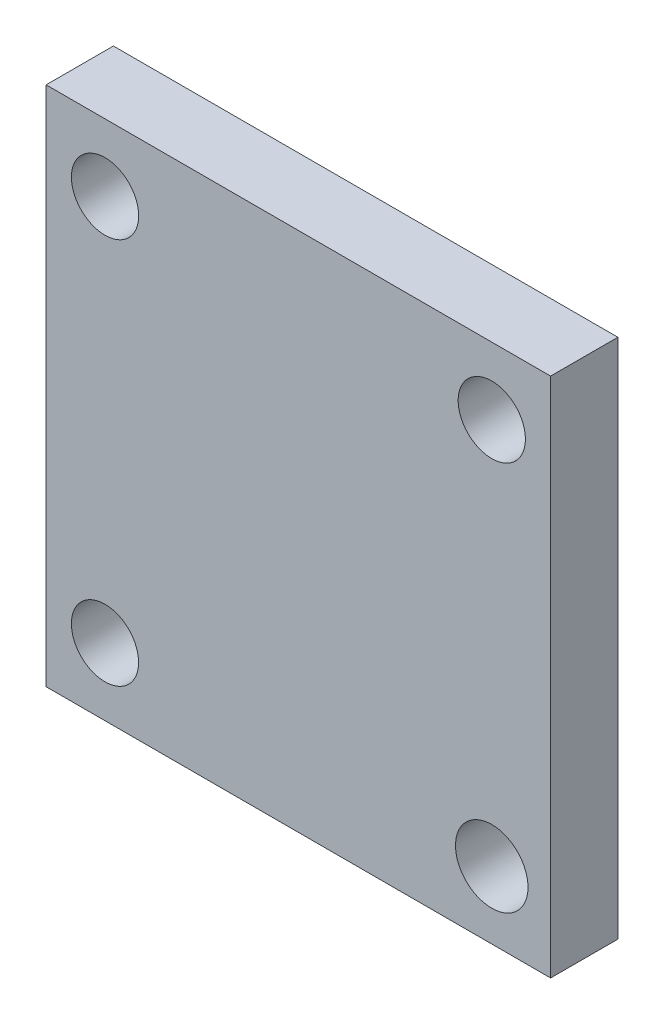
ISO-10303-21;
HEADER;
FILE_DESCRIPTION(('STEP AP214'),'2;1');
FILE_NAME('part.step','',(''),(''),'','','');
FILE_SCHEMA(('AUTOMOTIVE_DESIGN { 1 0 10303 214 1 1 1 1 }'));
ENDSEC;
DATA;
#1=APPLICATION_CONTEXT('core data for automotive mechanical design processes');
#2=APPLICATION_PROTOCOL_DEFINITION('international standard','automotive_design',2000,#1);
#3=PRODUCT_CONTEXT('',#1,'mechanical');
#4=PRODUCT('Part','Part','',(#3));
#5=PRODUCT_RELATED_PRODUCT_CATEGORY('part','',(#4));
#6=PRODUCT_DEFINITION_FORMATION('','',#4);
#7=PRODUCT_DEFINITION_CONTEXT('part definition',#1,'design');
#8=PRODUCT_DEFINITION('design','',#6,#7);
#9=PRODUCT_DEFINITION_SHAPE('','',#8);
#10=(LENGTH_UNIT() NAMED_UNIT(*) SI_UNIT(.MILLI.,.METRE.));
#11=(NAMED_UNIT(*) PLANE_ANGLE_UNIT() SI_UNIT($,.RADIAN.));
#12=(NAMED_UNIT(*) SI_UNIT($,.STERADIAN.) SOLID_ANGLE_UNIT());
#13=UNCERTAINTY_MEASURE_WITH_UNIT(LENGTH_MEASURE(1.E-05),#10,'distance_accuracy_value','');
#14=(GEOMETRIC_REPRESENTATION_CONTEXT(3) GLOBAL_UNCERTAINTY_ASSIGNED_CONTEXT((#13)) GLOBAL_UNIT_ASSIGNED_CONTEXT((#10,
#11,#12)) REPRESENTATION_CONTEXT('',''));
#15=CARTESIAN_POINT('',(0.,0.,0.));
#16=DIRECTION('',(0.,0.,1.));
#17=DIRECTION('',(1.,0.,0.));
#18=AXIS2_PLACEMENT_3D('',#15,#16,#17);
#19=CARTESIAN_POINT('',(0.,0.,4.));
#20=DIRECTION('',(0.,0.,1.));
#21=DIRECTION('',(1.,0.,0.));
#22=AXIS2_PLACEMENT_3D('',#19,#20,#21);
#23=PLANE('',#22);
#24=CARTESIAN_POINT('',(-11.501091744182,-11.4989082558181,4.));
#25=DIRECTION('',(0.,0.,1.));
#26=DIRECTION('',(1.,0.,0.));
#27=AXIS2_PLACEMENT_3D('',#24,#25,#26);
#28=CIRCLE('',#27,2.);
#29=CARTESIAN_POINT('',(-9.50109174418201,-11.4989082558181,4.));
#30=VERTEX_POINT('',#29);
#31=EDGE_CURVE('E122',#30,#30,#28,.T.);
#32=ORIENTED_EDGE('',*,*,#31,.F.);
#33=EDGE_LOOP('',(#32));
#34=FACE_BOUND('',#33,.T.);
#35=CARTESIAN_POINT('',(-11.4989082558179,11.5032752325463,4.));
#36=DIRECTION('',(0.,0.,1.));
#37=DIRECTION('',(1.,0.,0.));
#38=AXIS2_PLACEMENT_3D('',#35,#36,#37);
#39=CIRCLE('',#38,2.);
#40=CARTESIAN_POINT('',(-9.49890825581793,11.5032752325463,4.));
#41=VERTEX_POINT('',#40);
#42=EDGE_CURVE('E101',#41,#41,#39,.T.);
#43=ORIENTED_EDGE('',*,*,#42,.F.);
#44=EDGE_LOOP('',(#43));
#45=FACE_BOUND('',#44,.T.);
#46=DIRECTION('',(0.,1.,0.));
#47=VECTOR('',#46,1.);
#48=CARTESIAN_POINT('',(15.001091744182,-15.5010917441821,4.));
#49=LINE('',#48,#47);
#50=CARTESIAN_POINT('',(15.001091744182,-15.5010917441821,4.));
#51=VERTEX_POINT('',#50);
#52=CARTESIAN_POINT('',(15.001091744182,15.5010917441821,4.));
#53=VERTEX_POINT('',#52);
#54=EDGE_CURVE('E86',#51,#53,#49,.T.);
#55=ORIENTED_EDGE('',*,*,#54,.T.);
#56=DIRECTION('',(-1.,0.,0.));
#57=VECTOR('',#56,1.);
#58=CARTESIAN_POINT('',(15.001091744182,15.5010917441821,4.));
#59=LINE('',#58,#57);
#60=CARTESIAN_POINT('',(-15.001091744182,15.5010917441821,4.));
#61=VERTEX_POINT('',#60);
#62=EDGE_CURVE('E81',#53,#61,#59,.T.);
#63=ORIENTED_EDGE('',*,*,#62,.T.);
#64=DIRECTION('',(0.,-1.,0.));
#65=VECTOR('',#64,1.);
#66=CARTESIAN_POINT('',(-15.001091744182,-15.5010917441821,4.));
#67=LINE('',#66,#65);
#68=CARTESIAN_POINT('',(-15.001091744182,-15.5010917441821,4.));
#69=VERTEX_POINT('',#68);
#70=EDGE_CURVE('E84',#61,#69,#67,.T.);
#71=ORIENTED_EDGE('',*,*,#70,.T.);
#72=DIRECTION('',(1.,0.,0.));
#73=VECTOR('',#72,1.);
#74=CARTESIAN_POINT('',(15.001091744182,-15.5010917441821,4.));
#75=LINE('',#74,#73);
#76=EDGE_CURVE('E51',#69,#51,#75,.T.);
#77=ORIENTED_EDGE('',*,*,#76,.T.);
#78=EDGE_LOOP('',(#55,#63,#71,#77));
#79=FACE_BOUND('',#78,.T.);
#80=CARTESIAN_POINT('',(11.5032752325464,11.5010917441821,4.));
#81=DIRECTION('',(0.,0.,1.));
#82=DIRECTION('',(1.,0.,0.));
#83=AXIS2_PLACEMENT_3D('',#80,#81,#82);
#84=CIRCLE('',#83,2.);
#85=CARTESIAN_POINT('',(13.5032752325464,11.5010917441821,4.));
#86=VERTEX_POINT('',#85);
#87=EDGE_CURVE('E116',#86,#86,#84,.T.);
#88=ORIENTED_EDGE('',*,*,#87,.F.);
#89=EDGE_LOOP('',(#88));
#90=FACE_BOUND('',#89,.T.);
#91=CARTESIAN_POINT('',(11.5010917441823,-11.5010917441821,4.));
#92=DIRECTION('',(0.,0.,1.));
#93=DIRECTION('',(1.,0.,0.));
#94=AXIS2_PLACEMENT_3D('',#91,#92,#93);
#95=CIRCLE('',#94,2.15626689761665);
#96=CARTESIAN_POINT('',(13.657358641799,-11.5010917441821,4.));
#97=VERTEX_POINT('',#96);
#98=EDGE_CURVE('E128',#97,#97,#95,.T.);
#99=ORIENTED_EDGE('',*,*,#98,.F.);
#100=EDGE_LOOP('',(#99));
#101=FACE_BOUND('',#100,.T.);
#102=ADVANCED_FACE('F34',(#34,#45,#79,#90,#101),#23,.T.);
#103=CARTESIAN_POINT('',(0.,0.,0.));
#104=DIRECTION('',(0.,0.,1.));
#105=DIRECTION('',(1.,0.,0.));
#106=AXIS2_PLACEMENT_3D('',#103,#104,#105);
#107=PLANE('',#106);
#108=DIRECTION('',(0.,1.,0.));
#109=VECTOR('',#108,1.);
#110=CARTESIAN_POINT('',(15.001091744182,-15.5010917441821,0.));
#111=LINE('',#110,#109);
#112=CARTESIAN_POINT('',(15.001091744182,-15.5010917441821,0.));
#113=VERTEX_POINT('',#112);
#114=CARTESIAN_POINT('',(15.001091744182,15.5010917441821,0.));
#115=VERTEX_POINT('',#114);
#116=EDGE_CURVE('E98',#113,#115,#111,.T.);
#117=ORIENTED_EDGE('',*,*,#116,.F.);
#118=DIRECTION('',(1.,0.,0.));
#119=VECTOR('',#118,1.);
#120=CARTESIAN_POINT('',(15.001091744182,-15.5010917441821,0.));
#121=LINE('',#120,#119);
#122=CARTESIAN_POINT('',(-15.001091744182,-15.5010917441821,0.));
#123=VERTEX_POINT('',#122);
#124=EDGE_CURVE('E74',#123,#113,#121,.T.);
#125=ORIENTED_EDGE('',*,*,#124,.F.);
#126=DIRECTION('',(0.,-1.,0.));
#127=VECTOR('',#126,1.);
#128=CARTESIAN_POINT('',(-15.001091744182,-15.5010917441821,0.));
#129=LINE('',#128,#127);
#130=CARTESIAN_POINT('',(-15.001091744182,15.5010917441821,0.));
#131=VERTEX_POINT('',#130);
#132=EDGE_CURVE('E68',#131,#123,#129,.T.);
#133=ORIENTED_EDGE('',*,*,#132,.F.);
#134=DIRECTION('',(-1.,0.,0.));
#135=VECTOR('',#134,1.);
#136=CARTESIAN_POINT('',(15.001091744182,15.5010917441821,0.));
#137=LINE('',#136,#135);
#138=EDGE_CURVE('E90',#115,#131,#137,.T.);
#139=ORIENTED_EDGE('',*,*,#138,.F.);
#140=EDGE_LOOP('',(#117,#125,#133,#139));
#141=FACE_BOUND('',#140,.T.);
#142=CARTESIAN_POINT('',(-11.4989082558179,11.5032752325463,0.));
#143=DIRECTION('',(0.,0.,1.));
#144=DIRECTION('',(1.,0.,0.));
#145=AXIS2_PLACEMENT_3D('',#142,#143,#144);
#146=CIRCLE('',#145,2.);
#147=CARTESIAN_POINT('',(-9.49890825581793,11.5032752325463,0.));
#148=VERTEX_POINT('',#147);
#149=EDGE_CURVE('E113',#148,#148,#146,.T.);
#150=ORIENTED_EDGE('',*,*,#149,.T.);
#151=EDGE_LOOP('',(#150));
#152=FACE_BOUND('',#151,.T.);
#153=CARTESIAN_POINT('',(11.5032752325464,11.5010917441821,0.));
#154=DIRECTION('',(0.,0.,1.));
#155=DIRECTION('',(1.,0.,0.));
#156=AXIS2_PLACEMENT_3D('',#153,#154,#155);
#157=CIRCLE('',#156,2.);
#158=CARTESIAN_POINT('',(13.5032752325464,11.5010917441821,0.));
#159=VERTEX_POINT('',#158);
#160=EDGE_CURVE('E119',#159,#159,#157,.T.);
#161=ORIENTED_EDGE('',*,*,#160,.T.);
#162=EDGE_LOOP('',(#161));
#163=FACE_BOUND('',#162,.T.);
#164=CARTESIAN_POINT('',(-11.501091744182,-11.4989082558181,0.));
#165=DIRECTION('',(0.,0.,1.));
#166=DIRECTION('',(1.,0.,0.));
#167=AXIS2_PLACEMENT_3D('',#164,#165,#166);
#168=CIRCLE('',#167,2.);
#169=CARTESIAN_POINT('',(-9.50109174418201,-11.4989082558181,0.));
#170=VERTEX_POINT('',#169);
#171=EDGE_CURVE('E125',#170,#170,#168,.T.);
#172=ORIENTED_EDGE('',*,*,#171,.T.);
#173=EDGE_LOOP('',(#172));
#174=FACE_BOUND('',#173,.T.);
#175=CARTESIAN_POINT('',(11.5010917441823,-11.5010917441821,0.));
#176=DIRECTION('',(0.,0.,1.));
#177=DIRECTION('',(1.,0.,0.));
#178=AXIS2_PLACEMENT_3D('',#175,#176,#177);
#179=CIRCLE('',#178,2.15626689761665);
#180=CARTESIAN_POINT('',(13.657358641799,-11.5010917441821,0.));
#181=VERTEX_POINT('',#180);
#182=EDGE_CURVE('E131',#181,#181,#179,.T.);
#183=ORIENTED_EDGE('',*,*,#182,.T.);
#184=EDGE_LOOP('',(#183));
#185=FACE_BOUND('',#184,.T.);
#186=ADVANCED_FACE('F109',(#141,#152,#163,#174,#185),#107,.F.);
#187=CARTESIAN_POINT('',(15.001091744182,-15.5010917441821,4.));
#188=DIRECTION('',(-1.,0.,0.));
#189=DIRECTION('',(0.,0.,1.));
#190=AXIS2_PLACEMENT_3D('',#187,#188,#189);
#191=PLANE('',#190);
#192=ORIENTED_EDGE('',*,*,#116,.T.);
#193=DIRECTION('',(0.,0.,-1.));
#194=VECTOR('',#193,1.);
#195=CARTESIAN_POINT('',(15.001091744182,15.5010917441821,4.));
#196=LINE('',#195,#194);
#197=EDGE_CURVE('E11',#53,#115,#196,.T.);
#198=ORIENTED_EDGE('',*,*,#197,.F.);
#199=ORIENTED_EDGE('',*,*,#54,.F.);
#200=DIRECTION('',(0.,0.,-1.));
#201=VECTOR('',#200,1.);
#202=CARTESIAN_POINT('',(15.001091744182,-15.5010917441821,4.));
#203=LINE('',#202,#201);
#204=EDGE_CURVE('E94',#51,#113,#203,.T.);
#205=ORIENTED_EDGE('',*,*,#204,.T.);
#206=EDGE_LOOP('',(#192,#198,#199,#205));
#207=FACE_BOUND('',#206,.T.);
#208=ADVANCED_FACE('F36',(#207),#191,.F.);
#209=CARTESIAN_POINT('',(15.001091744182,15.5010917441821,4.));
#210=DIRECTION('',(0.,-1.,0.));
#211=DIRECTION('',(1.,0.,0.));
#212=AXIS2_PLACEMENT_3D('',#209,#210,#211);
#213=PLANE('',#212);
#214=ORIENTED_EDGE('',*,*,#138,.T.);
#215=DIRECTION('',(0.,0.,-1.));
#216=VECTOR('',#215,1.);
#217=CARTESIAN_POINT('',(-15.001091744182,15.5010917441821,4.));
#218=LINE('',#217,#216);
#219=EDGE_CURVE('E43',#61,#131,#218,.T.);
#220=ORIENTED_EDGE('',*,*,#219,.F.);
#221=ORIENTED_EDGE('',*,*,#62,.F.);
#222=ORIENTED_EDGE('',*,*,#197,.T.);
#223=EDGE_LOOP('',(#214,#220,#221,#222));
#224=FACE_BOUND('',#223,.T.);
#225=ADVANCED_FACE('F89',(#224),#213,.F.);
#226=CARTESIAN_POINT('',(-15.001091744182,-15.5010917441821,4.));
#227=DIRECTION('',(1.,0.,0.));
#228=DIRECTION('',(0.,0.,-1.));
#229=AXIS2_PLACEMENT_3D('',#226,#227,#228);
#230=PLANE('',#229);
#231=ORIENTED_EDGE('',*,*,#132,.T.);
#232=DIRECTION('',(0.,0.,-1.));
#233=VECTOR('',#232,1.);
#234=CARTESIAN_POINT('',(-15.001091744182,-15.5010917441821,4.));
#235=LINE('',#234,#233);
#236=EDGE_CURVE('E91',#69,#123,#235,.T.);
#237=ORIENTED_EDGE('',*,*,#236,.F.);
#238=ORIENTED_EDGE('',*,*,#70,.F.);
#239=ORIENTED_EDGE('',*,*,#219,.T.);
#240=EDGE_LOOP('',(#231,#237,#238,#239));
#241=FACE_BOUND('',#240,.T.);
#242=ADVANCED_FACE('F92',(#241),#230,.F.);
#243=CARTESIAN_POINT('',(15.001091744182,-15.5010917441821,4.));
#244=DIRECTION('',(0.,1.,0.));
#245=DIRECTION('',(-1.,0.,0.));
#246=AXIS2_PLACEMENT_3D('',#243,#244,#245);
#247=PLANE('',#246);
#248=ORIENTED_EDGE('',*,*,#124,.T.);
#249=ORIENTED_EDGE('',*,*,#204,.F.);
#250=ORIENTED_EDGE('',*,*,#76,.F.);
#251=ORIENTED_EDGE('',*,*,#236,.T.);
#252=EDGE_LOOP('',(#248,#249,#250,#251));
#253=FACE_BOUND('',#252,.T.);
#254=ADVANCED_FACE('F106',(#253),#247,.F.);
#255=CARTESIAN_POINT('',(-11.4989082558179,11.5032752325463,4.));
#256=DIRECTION('',(0.,0.,-1.));
#257=DIRECTION('',(-1.,0.,0.));
#258=AXIS2_PLACEMENT_3D('',#255,#256,#257);
#259=CYLINDRICAL_SURFACE('',#258,2.);
#260=ORIENTED_EDGE('',*,*,#42,.T.);
#261=EDGE_LOOP('',(#260));
#262=FACE_BOUND('',#261,.T.);
#263=ORIENTED_EDGE('',*,*,#149,.F.);
#264=EDGE_LOOP('',(#263));
#265=FACE_BOUND('',#264,.T.);
#266=ADVANCED_FACE('F150',(#262,#265),#259,.F.);
#267=CARTESIAN_POINT('',(11.5032752325464,11.5010917441821,4.));
#268=DIRECTION('',(0.,0.,-1.));
#269=DIRECTION('',(-1.,0.,0.));
#270=AXIS2_PLACEMENT_3D('',#267,#268,#269);
#271=CYLINDRICAL_SURFACE('',#270,2.);
#272=ORIENTED_EDGE('',*,*,#87,.T.);
#273=EDGE_LOOP('',(#272));
#274=FACE_BOUND('',#273,.T.);
#275=ORIENTED_EDGE('',*,*,#160,.F.);
#276=EDGE_LOOP('',(#275));
#277=FACE_BOUND('',#276,.T.);
#278=ADVANCED_FACE('F196',(#274,#277),#271,.F.);
#279=CARTESIAN_POINT('',(-11.501091744182,-11.4989082558181,4.));
#280=DIRECTION('',(0.,0.,-1.));
#281=DIRECTION('',(-1.,0.,0.));
#282=AXIS2_PLACEMENT_3D('',#279,#280,#281);
#283=CYLINDRICAL_SURFACE('',#282,2.);
#284=ORIENTED_EDGE('',*,*,#31,.T.);
#285=EDGE_LOOP('',(#284));
#286=FACE_BOUND('',#285,.T.);
#287=ORIENTED_EDGE('',*,*,#171,.F.);
#288=EDGE_LOOP('',(#287));
#289=FACE_BOUND('',#288,.T.);
#290=ADVANCED_FACE('F204',(#286,#289),#283,.F.);
#291=CARTESIAN_POINT('',(11.5010917441823,-11.5010917441821,4.));
#292=DIRECTION('',(0.,0.,-1.));
#293=DIRECTION('',(-1.,0.,0.));
#294=AXIS2_PLACEMENT_3D('',#291,#292,#293);
#295=CYLINDRICAL_SURFACE('',#294,2.15626689761665);
#296=ORIENTED_EDGE('',*,*,#98,.T.);
#297=EDGE_LOOP('',(#296));
#298=FACE_BOUND('',#297,.T.);
#299=ORIENTED_EDGE('',*,*,#182,.F.);
#300=EDGE_LOOP('',(#299));
#301=FACE_BOUND('',#300,.T.);
#302=ADVANCED_FACE('F137',(#298,#301),#295,.F.);
#303=CLOSED_SHELL('',(#102,#186,#208,#225,#242,#254,#266,#278,#290,#302));
#304=MANIFOLD_SOLID_BREP('B2',#303);
#305=ADVANCED_BREP_SHAPE_REPRESENTATION('',(#18,#304),#14);
#306=SHAPE_DEFINITION_REPRESENTATION(#9,#305);
ENDSEC;
END-ISO-10303-21;
